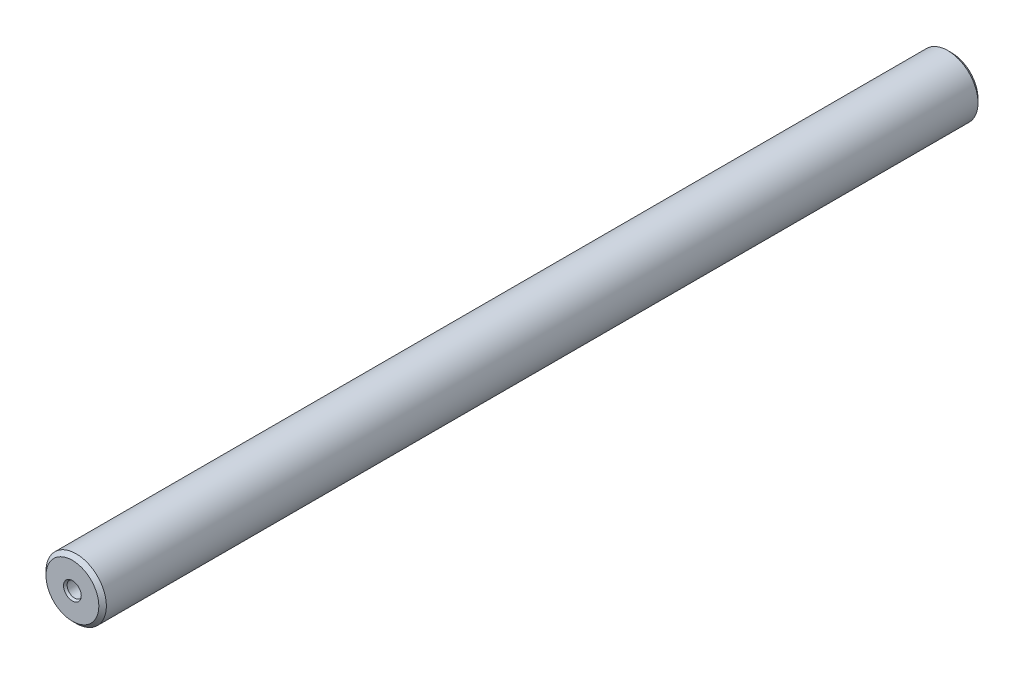
ISO-10303-21;
HEADER;
FILE_DESCRIPTION(('STEP AP214'),'2;1');
FILE_NAME('part.step','',(''),(''),'','','');
FILE_SCHEMA(('AUTOMOTIVE_DESIGN { 1 0 10303 214 1 1 1 1 }'));
ENDSEC;
DATA;
#1=APPLICATION_CONTEXT('core data for automotive mechanical design processes');
#2=APPLICATION_PROTOCOL_DEFINITION('international standard','automotive_design',2000,#1);
#3=PRODUCT_CONTEXT('',#1,'mechanical');
#4=PRODUCT('Part','Part','',(#3));
#5=PRODUCT_RELATED_PRODUCT_CATEGORY('part','',(#4));
#6=PRODUCT_DEFINITION_FORMATION('','',#4);
#7=PRODUCT_DEFINITION_CONTEXT('part definition',#1,'design');
#8=PRODUCT_DEFINITION('design','',#6,#7);
#9=PRODUCT_DEFINITION_SHAPE('','',#8);
#10=(LENGTH_UNIT() NAMED_UNIT(*) SI_UNIT(.MILLI.,.METRE.));
#11=(NAMED_UNIT(*) PLANE_ANGLE_UNIT() SI_UNIT($,.RADIAN.));
#12=(NAMED_UNIT(*) SI_UNIT($,.STERADIAN.) SOLID_ANGLE_UNIT());
#13=UNCERTAINTY_MEASURE_WITH_UNIT(LENGTH_MEASURE(1.E-05),#10,'distance_accuracy_value','');
#14=(GEOMETRIC_REPRESENTATION_CONTEXT(3) GLOBAL_UNCERTAINTY_ASSIGNED_CONTEXT((#13)) GLOBAL_UNIT_ASSIGNED_CONTEXT((#10,
#11,#12)) REPRESENTATION_CONTEXT('',''));
#15=CARTESIAN_POINT('',(0.,0.,0.));
#16=DIRECTION('',(0.,0.,1.));
#17=DIRECTION('',(1.,0.,0.));
#18=AXIS2_PLACEMENT_3D('',#15,#16,#17);
#19=CARTESIAN_POINT('',(0.,0.,-116.326794919243));
#20=DIRECTION('',(0.,0.,-1.));
#21=DIRECTION('',(1.,0.,0.));
#22=AXIS2_PLACEMENT_3D('',#19,#20,#21);
#23=CONICAL_SURFACE('',#22,1.,1.04719755119659);
#24=CARTESIAN_POINT('',(0.,0.,-116.326794919243));
#25=DIRECTION('',(0.,0.,1.));
#26=DIRECTION('',(-1.,0.,0.));
#27=AXIS2_PLACEMENT_3D('',#24,#25,#26);
#28=CIRCLE('',#27,1.);
#29=CARTESIAN_POINT('',(-0.999999999999985,0.,-116.326794919243));
#30=VERTEX_POINT('',#29);
#31=EDGE_CURVE('E126',#30,#30,#28,.T.);
#32=ORIENTED_EDGE('',*,*,#31,.T.);
#33=DIRECTION('',(-0.866025403784436,0.,-0.5));
#34=VECTOR('',#33,1.);
#35=CARTESIAN_POINT('',(-0.999999999999985,0.,-116.326794919243));
#36=LINE('',#35,#34);
#37=CARTESIAN_POINT('',(-1.30000000000002,0.,-116.5));
#38=VERTEX_POINT('',#37);
#39=EDGE_CURVE('E11',#30,#38,#36,.T.);
#40=ORIENTED_EDGE('',*,*,#39,.T.);
#41=CARTESIAN_POINT('',(0.,0.,-116.5));
#42=DIRECTION('',(0.,0.,-1.));
#43=DIRECTION('',(-1.,0.,0.));
#44=AXIS2_PLACEMENT_3D('',#41,#42,#43);
#45=CIRCLE('',#44,1.30000000000004);
#46=EDGE_CURVE('E120',#38,#38,#45,.T.);
#47=ORIENTED_EDGE('',*,*,#46,.T.);
#48=ORIENTED_EDGE('',*,*,#39,.F.);
#49=EDGE_LOOP('',(#32,#40,#47,#48));
#50=FACE_BOUND('',#49,.T.);
#51=ADVANCED_FACE('F16',(#50),#23,.F.);
#52=CARTESIAN_POINT('',(0.,0.,-114.5));
#53=DIRECTION('',(0.,0.,-1.));
#54=DIRECTION('',(1.,0.,0.));
#55=AXIS2_PLACEMENT_3D('',#52,#53,#54);
#56=CONICAL_SURFACE('',#55,0.826794919243167,0.52359877559831);
#57=CARTESIAN_POINT('',(0.,0.,-114.5));
#58=DIRECTION('',(0.,0.,1.));
#59=DIRECTION('',(-1.,0.,0.));
#60=AXIS2_PLACEMENT_3D('',#57,#58,#59);
#61=CIRCLE('',#60,0.826794919243167);
#62=CARTESIAN_POINT('',(-0.826794919243152,0.,-114.5));
#63=VERTEX_POINT('',#62);
#64=EDGE_CURVE('E121',#63,#63,#61,.T.);
#65=ORIENTED_EDGE('',*,*,#64,.T.);
#66=DIRECTION('',(-0.50000000000001,0.,-0.866025403784433));
#67=VECTOR('',#66,1.);
#68=CARTESIAN_POINT('',(-0.826794919243152,0.,-114.5));
#69=LINE('',#68,#67);
#70=CARTESIAN_POINT('',(-0.999999999999985,0.,-114.8));
#71=VERTEX_POINT('',#70);
#72=EDGE_CURVE('E20',#63,#71,#69,.T.);
#73=ORIENTED_EDGE('',*,*,#72,.T.);
#74=CARTESIAN_POINT('',(0.,0.,-114.8));
#75=DIRECTION('',(0.,0.,-1.));
#76=DIRECTION('',(-1.,0.,0.));
#77=AXIS2_PLACEMENT_3D('',#74,#75,#76);
#78=CIRCLE('',#77,1.);
#79=EDGE_CURVE('E115',#71,#71,#78,.T.);
#80=ORIENTED_EDGE('',*,*,#79,.T.);
#81=ORIENTED_EDGE('',*,*,#72,.F.);
#82=EDGE_LOOP('',(#65,#73,#80,#81));
#83=FACE_BOUND('',#82,.T.);
#84=ADVANCED_FACE('F249',(#83),#56,.F.);
#85=CARTESIAN_POINT('',(0.,0.,0.));
#86=DIRECTION('',(0.,0.,1.));
#87=DIRECTION('',(-1.,0.,0.));
#88=AXIS2_PLACEMENT_3D('',#85,#86,#87);
#89=CONICAL_SURFACE('',#88,1.17320508075687,0.523598775598282);
#90=CARTESIAN_POINT('',(0.,0.,-0.299999999999981));
#91=DIRECTION('',(0.,0.,-1.));
#92=DIRECTION('',(1.,0.,0.));
#93=AXIS2_PLACEMENT_3D('',#90,#91,#92);
#94=CIRCLE('',#93,1.);
#95=CARTESIAN_POINT('',(1.,0.,-0.299999999999981));
#96=VERTEX_POINT('',#95);
#97=CARTESIAN_POINT('',(-1.,0.,-0.299999999999976));
#98=VERTEX_POINT('',#97);
#99=EDGE_CURVE('E110',#96,#98,#94,.T.);
#100=ORIENTED_EDGE('',*,*,#99,.T.);
#101=CARTESIAN_POINT('',(0.,0.,-0.299999999999981));
#102=DIRECTION('',(0.,0.,-1.));
#103=DIRECTION('',(1.,0.,0.));
#104=AXIS2_PLACEMENT_3D('',#101,#102,#103);
#105=CIRCLE('',#104,1.);
#106=EDGE_CURVE('E114',#98,#96,#105,.T.);
#107=ORIENTED_EDGE('',*,*,#106,.T.);
#108=DIRECTION('',(0.499999999999985,0.,0.866025403784447));
#109=VECTOR('',#108,1.);
#110=CARTESIAN_POINT('',(1.17320508075687,0.,0.));
#111=LINE('',#110,#109);
#112=CARTESIAN_POINT('',(1.17320508075687,0.,0.));
#113=VERTEX_POINT('',#112);
#114=EDGE_CURVE('E106',#96,#113,#111,.T.);
#115=ORIENTED_EDGE('',*,*,#114,.T.);
#116=CARTESIAN_POINT('',(0.,0.,0.));
#117=DIRECTION('',(0.,0.,1.));
#118=DIRECTION('',(1.,0.,0.));
#119=AXIS2_PLACEMENT_3D('',#116,#117,#118);
#120=CIRCLE('',#119,1.17320508075687);
#121=EDGE_CURVE('E130',#113,#113,#120,.T.);
#122=ORIENTED_EDGE('',*,*,#121,.T.);
#123=ORIENTED_EDGE('',*,*,#114,.F.);
#124=EDGE_LOOP('',(#100,#107,#115,#122,#123));
#125=FACE_BOUND('',#124,.T.);
#126=ADVANCED_FACE('F226',(#125),#89,.F.);
#127=CARTESIAN_POINT('',(0.,0.,-1.8267949192431));
#128=DIRECTION('',(0.,0.,1.));
#129=DIRECTION('',(-1.,0.,0.));
#130=AXIS2_PLACEMENT_3D('',#127,#128,#129);
#131=CONICAL_SURFACE('',#130,1.,1.04719755119657);
#132=CARTESIAN_POINT('',(0.,0.,-2.));
#133=DIRECTION('',(0.,0.,-1.));
#134=DIRECTION('',(1.,0.,0.));
#135=AXIS2_PLACEMENT_3D('',#132,#133,#134);
#136=CIRCLE('',#135,0.700000000000009);
#137=CARTESIAN_POINT('',(0.700000000000009,0.,-2.));
#138=VERTEX_POINT('',#137);
#139=EDGE_CURVE('E125',#138,#138,#136,.T.);
#140=ORIENTED_EDGE('',*,*,#139,.T.);
#141=DIRECTION('',(0.866025403784423,0.,0.500000000000027));
#142=VECTOR('',#141,1.);
#143=CARTESIAN_POINT('',(1.,0.,-1.8267949192431));
#144=LINE('',#143,#142);
#145=CARTESIAN_POINT('',(1.,0.,-1.8267949192431));
#146=VERTEX_POINT('',#145);
#147=EDGE_CURVE('E40',#138,#146,#144,.T.);
#148=ORIENTED_EDGE('',*,*,#147,.T.);
#149=CARTESIAN_POINT('',(0.,0.,-1.8267949192431));
#150=DIRECTION('',(0.,0.,1.));
#151=DIRECTION('',(1.,0.,0.));
#152=AXIS2_PLACEMENT_3D('',#149,#150,#151);
#153=CIRCLE('',#152,1.);
#154=CARTESIAN_POINT('',(-1.,0.,-1.82679491924311));
#155=VERTEX_POINT('',#154);
#156=EDGE_CURVE('E131',#146,#155,#153,.T.);
#157=ORIENTED_EDGE('',*,*,#156,.T.);
#158=CARTESIAN_POINT('',(0.,0.,-1.8267949192431));
#159=DIRECTION('',(0.,0.,1.));
#160=DIRECTION('',(1.,0.,0.));
#161=AXIS2_PLACEMENT_3D('',#158,#159,#160);
#162=CIRCLE('',#161,1.);
#163=EDGE_CURVE('E135',#155,#146,#162,.T.);
#164=ORIENTED_EDGE('',*,*,#163,.T.);
#165=ORIENTED_EDGE('',*,*,#147,.F.);
#166=EDGE_LOOP('',(#140,#148,#157,#164,#165));
#167=FACE_BOUND('',#166,.T.);
#168=ADVANCED_FACE('F263',(#167),#131,.F.);
#169=CARTESIAN_POINT('',(0.,0.,-116.5));
#170=DIRECTION('',(0.,0.,1.));
#171=DIRECTION('',(-1.,0.,0.));
#172=AXIS2_PLACEMENT_3D('',#169,#170,#171);
#173=CONICAL_SURFACE('',#172,3.5,0.785398163397445);
#174=CARTESIAN_POINT('',(0.,0.,-116.));
#175=DIRECTION('',(0.,0.,-1.));
#176=DIRECTION('',(-1.,0.,0.));
#177=AXIS2_PLACEMENT_3D('',#174,#175,#176);
#178=CIRCLE('',#177,4.);
#179=CARTESIAN_POINT('',(-4.,0.,-116.));
#180=VERTEX_POINT('',#179);
#181=CARTESIAN_POINT('',(4.,0.,-116.));
#182=VERTEX_POINT('',#181);
#183=EDGE_CURVE('E103',#180,#182,#178,.T.);
#184=ORIENTED_EDGE('',*,*,#183,.T.);
#185=DIRECTION('',(-0.707106781186545,0.,-0.70710678118655));
#186=VECTOR('',#185,1.);
#187=CARTESIAN_POINT('',(3.50000000000005,0.,-116.5));
#188=LINE('',#187,#186);
#189=CARTESIAN_POINT('',(3.50000000000005,0.,-116.5));
#190=VERTEX_POINT('',#189);
#191=EDGE_CURVE('E137',#182,#190,#188,.T.);
#192=ORIENTED_EDGE('',*,*,#191,.T.);
#193=CARTESIAN_POINT('',(0.,0.,-116.5));
#194=DIRECTION('',(0.,0.,1.));
#195=DIRECTION('',(-1.,0.,0.));
#196=AXIS2_PLACEMENT_3D('',#193,#194,#195);
#197=CIRCLE('',#196,3.5);
#198=CARTESIAN_POINT('',(-3.5,0.,-116.5));
#199=VERTEX_POINT('',#198);
#200=EDGE_CURVE('E154',#190,#199,#197,.T.);
#201=ORIENTED_EDGE('',*,*,#200,.T.);
#202=CARTESIAN_POINT('',(0.,0.,-116.5));
#203=DIRECTION('',(0.,0.,1.));
#204=DIRECTION('',(-1.,0.,0.));
#205=AXIS2_PLACEMENT_3D('',#202,#203,#204);
#206=CIRCLE('',#205,3.5);
#207=EDGE_CURVE('E150',#199,#190,#206,.T.);
#208=ORIENTED_EDGE('',*,*,#207,.T.);
#209=ORIENTED_EDGE('',*,*,#191,.F.);
#210=CARTESIAN_POINT('',(0.,0.,-116.));
#211=DIRECTION('',(0.,0.,-1.));
#212=DIRECTION('',(-1.,0.,0.));
#213=AXIS2_PLACEMENT_3D('',#210,#211,#212);
#214=CIRCLE('',#213,4.);
#215=EDGE_CURVE('E92',#182,#180,#214,.T.);
#216=ORIENTED_EDGE('',*,*,#215,.T.);
#217=EDGE_LOOP('',(#184,#192,#201,#208,#209,#216));
#218=FACE_BOUND('',#217,.T.);
#219=ADVANCED_FACE('F197',(#218),#173,.T.);
#220=CARTESIAN_POINT('',(0.,0.,-0.499999999999973));
#221=DIRECTION('',(0.,0.,-1.));
#222=DIRECTION('',(1.,0.,0.));
#223=AXIS2_PLACEMENT_3D('',#220,#221,#222);
#224=CONICAL_SURFACE('',#223,4.,0.78539816339746);
#225=CARTESIAN_POINT('',(0.,0.,-0.499999999999973));
#226=DIRECTION('',(0.,0.,1.));
#227=DIRECTION('',(1.,0.,0.));
#228=AXIS2_PLACEMENT_3D('',#225,#226,#227);
#229=CIRCLE('',#228,4.);
#230=CARTESIAN_POINT('',(4.,0.,-0.499999999999972));
#231=VERTEX_POINT('',#230);
#232=CARTESIAN_POINT('',(-4.,0.,-0.499999999999972));
#233=VERTEX_POINT('',#232);
#234=EDGE_CURVE('E85',#231,#233,#229,.T.);
#235=ORIENTED_EDGE('',*,*,#234,.T.);
#236=DIRECTION('',(0.707106781186556,0.,0.707106781186539));
#237=VECTOR('',#236,1.);
#238=CARTESIAN_POINT('',(-4.,0.,-0.499999999999973));
#239=LINE('',#238,#237);
#240=CARTESIAN_POINT('',(-3.5,0.,0.));
#241=VERTEX_POINT('',#240);
#242=EDGE_CURVE('E88',#233,#241,#239,.T.);
#243=ORIENTED_EDGE('',*,*,#242,.T.);
#244=CARTESIAN_POINT('',(0.,0.,0.));
#245=DIRECTION('',(0.,0.,-1.));
#246=DIRECTION('',(1.,0.,0.));
#247=AXIS2_PLACEMENT_3D('',#244,#245,#246);
#248=CIRCLE('',#247,3.5);
#249=CARTESIAN_POINT('',(3.5,0.,0.));
#250=VERTEX_POINT('',#249);
#251=EDGE_CURVE('E142',#241,#250,#248,.T.);
#252=ORIENTED_EDGE('',*,*,#251,.T.);
#253=CARTESIAN_POINT('',(0.,0.,0.));
#254=DIRECTION('',(0.,0.,-1.));
#255=DIRECTION('',(1.,0.,0.));
#256=AXIS2_PLACEMENT_3D('',#253,#254,#255);
#257=CIRCLE('',#256,3.5);
#258=EDGE_CURVE('E146',#250,#241,#257,.T.);
#259=ORIENTED_EDGE('',*,*,#258,.T.);
#260=ORIENTED_EDGE('',*,*,#242,.F.);
#261=CARTESIAN_POINT('',(0.,0.,-0.499999999999973));
#262=DIRECTION('',(0.,0.,1.));
#263=DIRECTION('',(1.,0.,0.));
#264=AXIS2_PLACEMENT_3D('',#261,#262,#263);
#265=CIRCLE('',#264,4.);
#266=EDGE_CURVE('E81',#233,#231,#265,.T.);
#267=ORIENTED_EDGE('',*,*,#266,.T.);
#268=EDGE_LOOP('',(#235,#243,#252,#259,#260,#267));
#269=FACE_BOUND('',#268,.T.);
#270=ADVANCED_FACE('F83',(#269),#224,.T.);
#271=CARTESIAN_POINT('',(0.,0.,-2.));
#272=DIRECTION('',(0.,0.,1.));
#273=DIRECTION('',(1.,0.,0.));
#274=AXIS2_PLACEMENT_3D('',#271,#272,#273);
#275=PLANE('',#274);
#276=ORIENTED_EDGE('',*,*,#139,.F.);
#277=EDGE_LOOP('',(#276));
#278=FACE_BOUND('',#277,.T.);
#279=ADVANCED_FACE('F18',(#278),#275,.T.);
#280=CARTESIAN_POINT('',(0.,0.,-114.5));
#281=DIRECTION('',(0.,0.,-1.));
#282=DIRECTION('',(0.,-1.,0.));
#283=AXIS2_PLACEMENT_3D('',#280,#281,#282);
#284=PLANE('',#283);
#285=ORIENTED_EDGE('',*,*,#64,.F.);
#286=EDGE_LOOP('',(#285));
#287=FACE_BOUND('',#286,.T.);
#288=ADVANCED_FACE('F258',(#287),#284,.T.);
#289=CARTESIAN_POINT('',(0.,0.,-114.5));
#290=DIRECTION('',(0.,0.,1.));
#291=DIRECTION('',(1.,0.,0.));
#292=AXIS2_PLACEMENT_3D('',#289,#290,#291);
#293=CYLINDRICAL_SURFACE('',#292,1.);
#294=ORIENTED_EDGE('',*,*,#79,.F.);
#295=DIRECTION('',(0.,0.,-1.));
#296=VECTOR('',#295,1.);
#297=CARTESIAN_POINT('',(-0.999999999999985,0.,-114.5));
#298=LINE('',#297,#296);
#299=EDGE_CURVE('E119',#71,#30,#298,.T.);
#300=ORIENTED_EDGE('',*,*,#299,.T.);
#301=ORIENTED_EDGE('',*,*,#31,.F.);
#302=ORIENTED_EDGE('',*,*,#299,.F.);
#303=EDGE_LOOP('',(#294,#300,#301,#302));
#304=FACE_BOUND('',#303,.T.);
#305=ADVANCED_FACE('F192',(#304),#293,.F.);
#306=CARTESIAN_POINT('',(-4.,0.,-116.5));
#307=DIRECTION('',(0.,0.,-1.));
#308=DIRECTION('',(0.,-1.,0.));
#309=AXIS2_PLACEMENT_3D('',#306,#307,#308);
#310=PLANE('',#309);
#311=ORIENTED_EDGE('',*,*,#46,.F.);
#312=EDGE_LOOP('',(#311));
#313=FACE_BOUND('',#312,.T.);
#314=ORIENTED_EDGE('',*,*,#207,.F.);
#315=ORIENTED_EDGE('',*,*,#200,.F.);
#316=EDGE_LOOP('',(#314,#315));
#317=FACE_BOUND('',#316,.T.);
#318=ADVANCED_FACE('F189',(#313,#317),#310,.T.);
#319=CARTESIAN_POINT('',(0.,0.,-119.));
#320=DIRECTION('',(0.,0.,1.));
#321=DIRECTION('',(1.,0.,0.));
#322=AXIS2_PLACEMENT_3D('',#319,#320,#321);
#323=CYLINDRICAL_SURFACE('',#322,4.);
#324=ORIENTED_EDGE('',*,*,#183,.F.);
#325=DIRECTION('',(0.,0.,1.));
#326=VECTOR('',#325,1.);
#327=CARTESIAN_POINT('',(-4.,0.,-119.));
#328=LINE('',#327,#326);
#329=EDGE_CURVE('E96',#180,#233,#328,.T.);
#330=ORIENTED_EDGE('',*,*,#329,.T.);
#331=ORIENTED_EDGE('',*,*,#234,.F.);
#332=ORIENTED_EDGE('',*,*,#266,.F.);
#333=ORIENTED_EDGE('',*,*,#329,.F.);
#334=ORIENTED_EDGE('',*,*,#215,.F.);
#335=EDGE_LOOP('',(#324,#330,#331,#332,#333,#334));
#336=FACE_BOUND('',#335,.T.);
#337=ADVANCED_FACE('F95',(#336),#323,.T.);
#338=CARTESIAN_POINT('',(-1.,0.,0.));
#339=DIRECTION('',(0.,0.,1.));
#340=DIRECTION('',(1.,0.,0.));
#341=AXIS2_PLACEMENT_3D('',#338,#339,#340);
#342=PLANE('',#341);
#343=ORIENTED_EDGE('',*,*,#121,.F.);
#344=EDGE_LOOP('',(#343));
#345=FACE_BOUND('',#344,.T.);
#346=ORIENTED_EDGE('',*,*,#258,.F.);
#347=ORIENTED_EDGE('',*,*,#251,.F.);
#348=EDGE_LOOP('',(#346,#347));
#349=FACE_BOUND('',#348,.T.);
#350=ADVANCED_FACE('F229',(#345,#349),#342,.T.);
#351=CARTESIAN_POINT('',(0.,0.,-119.));
#352=DIRECTION('',(0.,0.,1.));
#353=DIRECTION('',(1.,0.,0.));
#354=AXIS2_PLACEMENT_3D('',#351,#352,#353);
#355=CYLINDRICAL_SURFACE('',#354,1.);
#356=ORIENTED_EDGE('',*,*,#99,.F.);
#357=ORIENTED_EDGE('',*,*,#106,.F.);
#358=DIRECTION('',(0.,0.,-1.));
#359=VECTOR('',#358,1.);
#360=CARTESIAN_POINT('',(-0.999999999999985,0.,-119.));
#361=LINE('',#360,#359);
#362=EDGE_CURVE('E136',#98,#155,#361,.T.);
#363=ORIENTED_EDGE('',*,*,#362,.T.);
#364=ORIENTED_EDGE('',*,*,#156,.F.);
#365=ORIENTED_EDGE('',*,*,#163,.F.);
#366=ORIENTED_EDGE('',*,*,#362,.F.);
#367=EDGE_LOOP('',(#356,#357,#363,#364,#365,#366));
#368=FACE_BOUND('',#367,.T.);
#369=ADVANCED_FACE('F224',(#368),#355,.F.);
#370=CLOSED_SHELL('',(#51,#84,#126,#168,#219,#270,#279,#288,#305,#318,#337,#350,#369));
#371=MANIFOLD_SOLID_BREP('B1',#370);
#372=ADVANCED_BREP_SHAPE_REPRESENTATION('',(#18,#371),#14);
#373=SHAPE_DEFINITION_REPRESENTATION(#9,#372);
ENDSEC;
END-ISO-10303-21;
